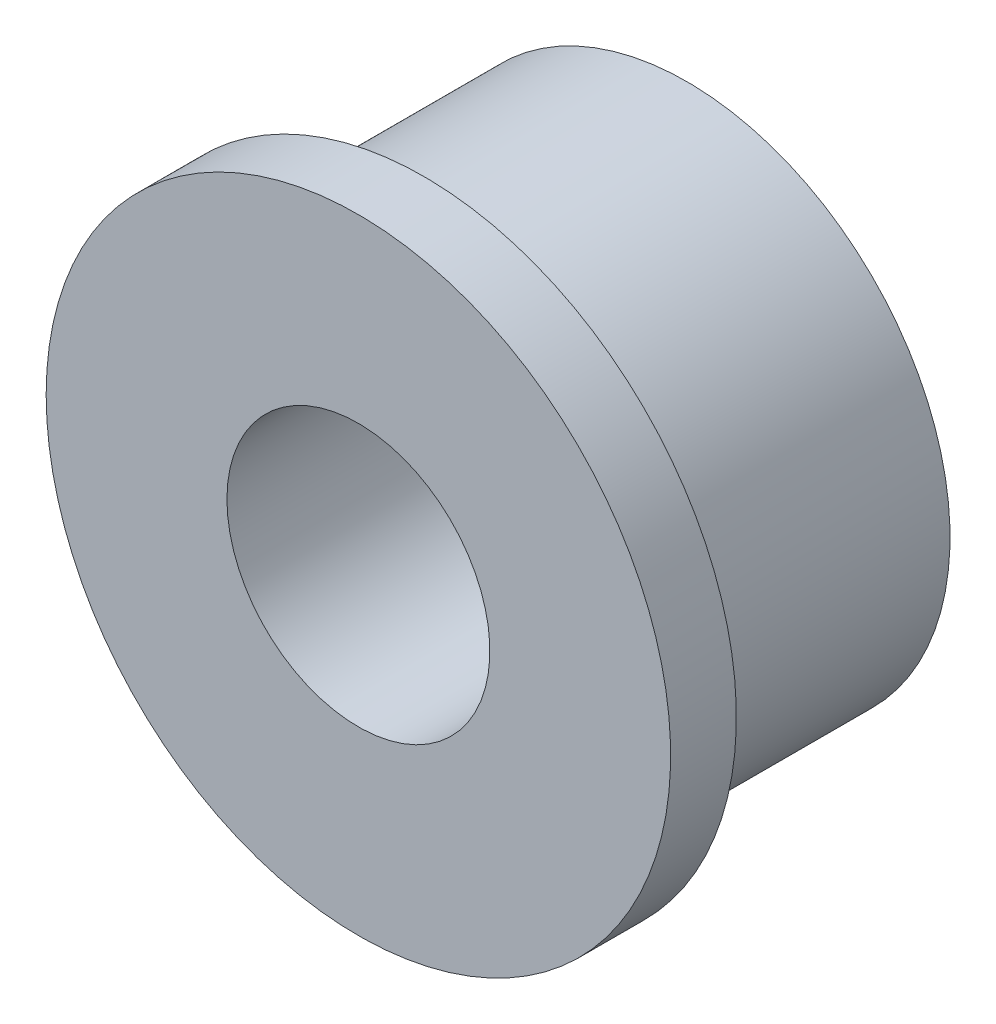
ISO-10303-21;
HEADER;
FILE_DESCRIPTION(('STEP AP214'),'2;1');
FILE_NAME('part.step','',(''),(''),'','','');
FILE_SCHEMA(('AUTOMOTIVE_DESIGN { 1 0 10303 214 1 1 1 1 }'));
ENDSEC;
DATA;
#1=APPLICATION_CONTEXT('core data for automotive mechanical design processes');
#2=APPLICATION_PROTOCOL_DEFINITION('international standard','automotive_design',2000,#1);
#3=PRODUCT_CONTEXT('',#1,'mechanical');
#4=PRODUCT('Part','Part','',(#3));
#5=PRODUCT_RELATED_PRODUCT_CATEGORY('part','',(#4));
#6=PRODUCT_DEFINITION_FORMATION('','',#4);
#7=PRODUCT_DEFINITION_CONTEXT('part definition',#1,'design');
#8=PRODUCT_DEFINITION('design','',#6,#7);
#9=PRODUCT_DEFINITION_SHAPE('','',#8);
#10=(LENGTH_UNIT() NAMED_UNIT(*) SI_UNIT(.MILLI.,.METRE.));
#11=(NAMED_UNIT(*) PLANE_ANGLE_UNIT() SI_UNIT($,.RADIAN.));
#12=(NAMED_UNIT(*) SI_UNIT($,.STERADIAN.) SOLID_ANGLE_UNIT());
#13=UNCERTAINTY_MEASURE_WITH_UNIT(LENGTH_MEASURE(1.E-05),#10,'distance_accuracy_value','');
#14=(GEOMETRIC_REPRESENTATION_CONTEXT(3) GLOBAL_UNCERTAINTY_ASSIGNED_CONTEXT((#13)) GLOBAL_UNIT_ASSIGNED_CONTEXT((#10,
#11,#12)) REPRESENTATION_CONTEXT('',''));
#15=CARTESIAN_POINT('',(0.,0.,0.));
#16=DIRECTION('',(0.,0.,1.));
#17=DIRECTION('',(1.,0.,0.));
#18=AXIS2_PLACEMENT_3D('',#15,#16,#17);
#19=CARTESIAN_POINT('',(-4.,0.,-7.19916984716117));
#20=DIRECTION('',(0.,0.,-1.));
#21=DIRECTION('',(-1.,0.,0.));
#22=AXIS2_PLACEMENT_3D('',#19,#20,#21);
#23=CONICAL_SURFACE('',#22,4.,0.959931088596884);
#24=CARTESIAN_POINT('',(-4.,0.,-10.));
#25=DIRECTION('',(0.,0.,-1.));
#26=DIRECTION('',(-1.,0.,0.));
#27=AXIS2_PLACEMENT_3D('',#24,#25,#26);
#28=CIRCLE('',#27,8.);
#29=CARTESIAN_POINT('',(-12.,0.,-10.));
#30=VERTEX_POINT('',#29);
#31=EDGE_CURVE('E56',#30,#30,#28,.T.);
#32=ORIENTED_EDGE('',*,*,#31,.T.);
#33=EDGE_LOOP('',(#32));
#34=FACE_BOUND('',#33,.T.);
#35=CARTESIAN_POINT('',(-4.,0.,-7.19916984716117));
#36=DIRECTION('',(0.,0.,-1.));
#37=DIRECTION('',(-1.,0.,0.));
#38=AXIS2_PLACEMENT_3D('',#35,#36,#37);
#39=CIRCLE('',#38,4.);
#40=CARTESIAN_POINT('',(-8.,0.,-7.19916984716117));
#41=VERTEX_POINT('',#40);
#42=EDGE_CURVE('E10',#41,#41,#39,.T.);
#43=ORIENTED_EDGE('',*,*,#42,.F.);
#44=EDGE_LOOP('',(#43));
#45=FACE_BOUND('',#44,.T.);
#46=ADVANCED_FACE('F34',(#34,#45),#23,.F.);
#47=CARTESIAN_POINT('',(-4.,0.,-5.52709359605912));
#48=DIRECTION('',(0.,0.,-1.));
#49=DIRECTION('',(-1.,0.,0.));
#50=AXIS2_PLACEMENT_3D('',#47,#48,#49);
#51=CYLINDRICAL_SURFACE('',#50,4.);
#52=ORIENTED_EDGE('',*,*,#42,.T.);
#53=EDGE_LOOP('',(#52));
#54=FACE_BOUND('',#53,.T.);
#55=CARTESIAN_POINT('',(-4.,0.,0.));
#56=DIRECTION('',(0.,0.,-1.));
#57=DIRECTION('',(-1.,0.,0.));
#58=AXIS2_PLACEMENT_3D('',#55,#56,#57);
#59=CIRCLE('',#58,4.);
#60=CARTESIAN_POINT('',(-8.,0.,0.));
#61=VERTEX_POINT('',#60);
#62=EDGE_CURVE('E40',#61,#61,#59,.T.);
#63=ORIENTED_EDGE('',*,*,#62,.F.);
#64=EDGE_LOOP('',(#63));
#65=FACE_BOUND('',#64,.T.);
#66=ADVANCED_FACE('F80',(#54,#65),#51,.F.);
#67=CARTESIAN_POINT('',(0.,0.,0.));
#68=DIRECTION('',(0.,0.,-1.));
#69=DIRECTION('',(-1.,0.,0.));
#70=AXIS2_PLACEMENT_3D('',#67,#68,#69);
#71=PLANE('',#70);
#72=CARTESIAN_POINT('',(-4.,0.,0.));
#73=DIRECTION('',(0.,0.,-1.));
#74=DIRECTION('',(-1.,0.,0.));
#75=AXIS2_PLACEMENT_3D('',#72,#73,#74);
#76=CIRCLE('',#75,9.5);
#77=CARTESIAN_POINT('',(-13.5,0.,0.));
#78=VERTEX_POINT('',#77);
#79=EDGE_CURVE('E44',#78,#78,#76,.T.);
#80=ORIENTED_EDGE('',*,*,#79,.F.);
#81=EDGE_LOOP('',(#80));
#82=FACE_BOUND('',#81,.T.);
#83=ORIENTED_EDGE('',*,*,#62,.T.);
#84=EDGE_LOOP('',(#83));
#85=FACE_BOUND('',#84,.T.);
#86=ADVANCED_FACE('F76',(#82,#85),#71,.F.);
#87=CARTESIAN_POINT('',(-4.,0.,-5.52709359605912));
#88=DIRECTION('',(0.,0.,-1.));
#89=DIRECTION('',(-1.,0.,0.));
#90=AXIS2_PLACEMENT_3D('',#87,#88,#89);
#91=CYLINDRICAL_SURFACE('',#90,9.5);
#92=CARTESIAN_POINT('',(-4.,0.,-2.));
#93=DIRECTION('',(0.,0.,-1.));
#94=DIRECTION('',(-1.,0.,0.));
#95=AXIS2_PLACEMENT_3D('',#92,#93,#94);
#96=CIRCLE('',#95,9.5);
#97=CARTESIAN_POINT('',(-13.5,0.,-2.));
#98=VERTEX_POINT('',#97);
#99=EDGE_CURVE('E48',#98,#98,#96,.T.);
#100=ORIENTED_EDGE('',*,*,#99,.F.);
#101=EDGE_LOOP('',(#100));
#102=FACE_BOUND('',#101,.T.);
#103=ORIENTED_EDGE('',*,*,#79,.T.);
#104=EDGE_LOOP('',(#103));
#105=FACE_BOUND('',#104,.T.);
#106=ADVANCED_FACE('F70',(#102,#105),#91,.T.);
#107=CARTESIAN_POINT('',(0.,0.,-2.));
#108=DIRECTION('',(0.,0.,-1.));
#109=DIRECTION('',(-1.,0.,0.));
#110=AXIS2_PLACEMENT_3D('',#107,#108,#109);
#111=PLANE('',#110);
#112=ORIENTED_EDGE('',*,*,#99,.T.);
#113=EDGE_LOOP('',(#112));
#114=FACE_BOUND('',#113,.T.);
#115=CARTESIAN_POINT('',(-4.,0.,-2.));
#116=DIRECTION('',(0.,0.,-1.));
#117=DIRECTION('',(-1.,0.,0.));
#118=AXIS2_PLACEMENT_3D('',#115,#116,#117);
#119=CIRCLE('',#118,8.);
#120=CARTESIAN_POINT('',(-12.,0.,-2.));
#121=VERTEX_POINT('',#120);
#122=EDGE_CURVE('E53',#121,#121,#119,.T.);
#123=ORIENTED_EDGE('',*,*,#122,.F.);
#124=EDGE_LOOP('',(#123));
#125=FACE_BOUND('',#124,.T.);
#126=ADVANCED_FACE('F65',(#114,#125),#111,.T.);
#127=CARTESIAN_POINT('',(-4.,0.,-5.52709359605912));
#128=DIRECTION('',(0.,0.,-1.));
#129=DIRECTION('',(-1.,0.,0.));
#130=AXIS2_PLACEMENT_3D('',#127,#128,#129);
#131=CYLINDRICAL_SURFACE('',#130,8.);
#132=ORIENTED_EDGE('',*,*,#31,.F.);
#133=EDGE_LOOP('',(#132));
#134=FACE_BOUND('',#133,.T.);
#135=ORIENTED_EDGE('',*,*,#122,.T.);
#136=EDGE_LOOP('',(#135));
#137=FACE_BOUND('',#136,.T.);
#138=ADVANCED_FACE('F62',(#134,#137),#131,.T.);
#139=CLOSED_SHELL('',(#46,#66,#86,#106,#126,#138));
#140=MANIFOLD_SOLID_BREP('B2',#139);
#141=ADVANCED_BREP_SHAPE_REPRESENTATION('',(#18,#140),#14);
#142=SHAPE_DEFINITION_REPRESENTATION(#9,#141);
ENDSEC;
END-ISO-10303-21;
